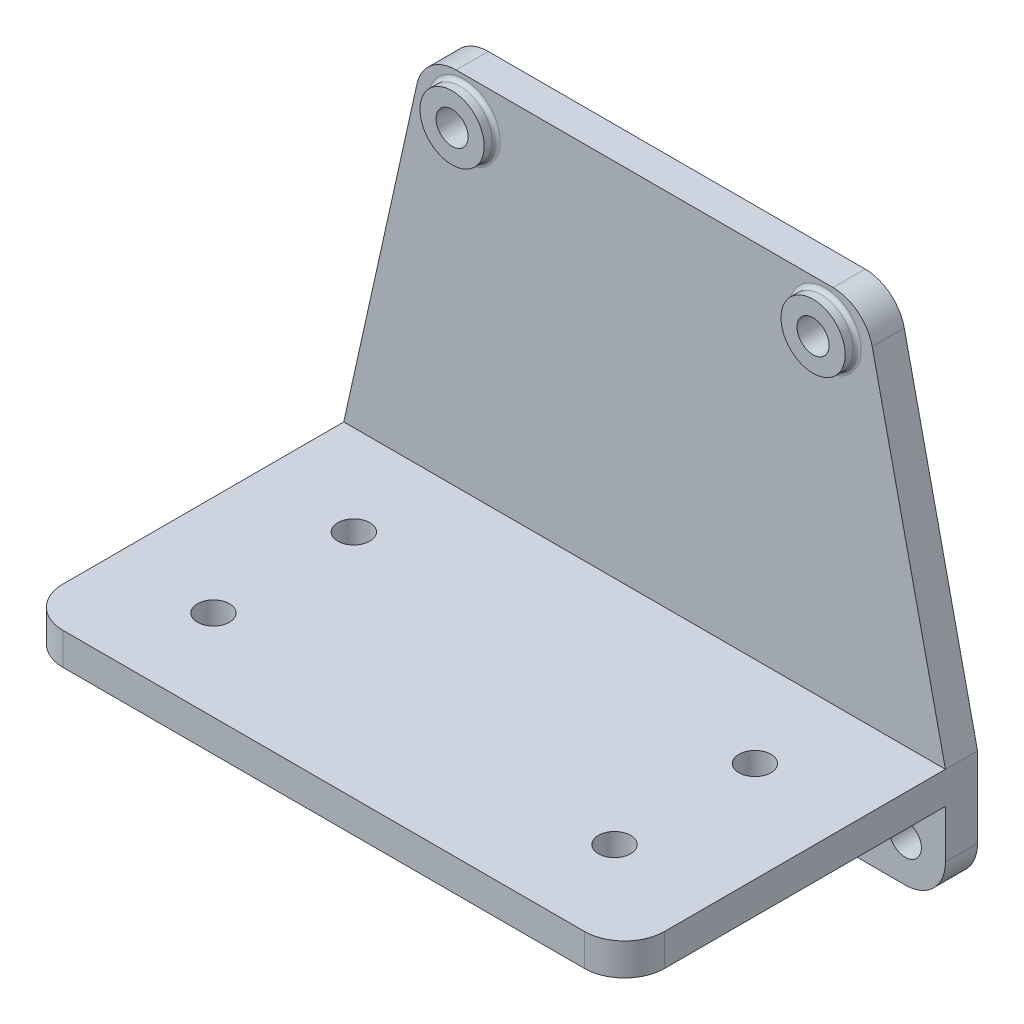
ISO-10303-21;
HEADER;
FILE_DESCRIPTION(('STEP AP214'),'2;1');
FILE_NAME('part.step','',(''),(''),'','','');
FILE_SCHEMA(('AUTOMOTIVE_DESIGN { 1 0 10303 214 1 1 1 1 }'));
ENDSEC;
DATA;
#1=APPLICATION_CONTEXT('core data for automotive mechanical design processes');
#2=APPLICATION_PROTOCOL_DEFINITION('international standard','automotive_design',2000,#1);
#3=PRODUCT_CONTEXT('',#1,'mechanical');
#4=PRODUCT('Part','Part','',(#3));
#5=PRODUCT_RELATED_PRODUCT_CATEGORY('part','',(#4));
#6=PRODUCT_DEFINITION_FORMATION('','',#4);
#7=PRODUCT_DEFINITION_CONTEXT('part definition',#1,'design');
#8=PRODUCT_DEFINITION('design','',#6,#7);
#9=PRODUCT_DEFINITION_SHAPE('','',#8);
#10=(LENGTH_UNIT() NAMED_UNIT(*) SI_UNIT(.MILLI.,.METRE.));
#11=(NAMED_UNIT(*) PLANE_ANGLE_UNIT() SI_UNIT($,.RADIAN.));
#12=(NAMED_UNIT(*) SI_UNIT($,.STERADIAN.) SOLID_ANGLE_UNIT());
#13=UNCERTAINTY_MEASURE_WITH_UNIT(LENGTH_MEASURE(1.E-05),#10,'distance_accuracy_value','');
#14=(GEOMETRIC_REPRESENTATION_CONTEXT(3) GLOBAL_UNCERTAINTY_ASSIGNED_CONTEXT((#13)) GLOBAL_UNIT_ASSIGNED_CONTEXT((#10,
#11,#12)) REPRESENTATION_CONTEXT('',''));
#15=CARTESIAN_POINT('',(0.,0.,0.));
#16=DIRECTION('',(0.,0.,1.));
#17=DIRECTION('',(1.,0.,0.));
#18=AXIS2_PLACEMENT_3D('',#15,#16,#17);
#19=CARTESIAN_POINT('',(0.,0.,8.));
#20=DIRECTION('',(0.,0.,1.));
#21=DIRECTION('',(1.,0.,0.));
#22=AXIS2_PLACEMENT_3D('',#19,#20,#21);
#23=PLANE('',#22);
#24=CARTESIAN_POINT('',(45.,110.,8.));
#25=DIRECTION('',(0.,0.,1.));
#26=DIRECTION('',(1.,0.,0.));
#27=AXIS2_PLACEMENT_3D('',#24,#25,#26);
#28=CIRCLE('',#27,9.);
#29=CARTESIAN_POINT('',(54.,110.,8.));
#30=VERTEX_POINT('',#29);
#31=EDGE_CURVE('E43',#30,#30,#28,.F.);
#32=ORIENTED_EDGE('',*,*,#31,.T.);
#33=EDGE_LOOP('',(#32));
#34=FACE_BOUND('',#33,.T.);
#35=CARTESIAN_POINT('',(-45.,110.,8.));
#36=DIRECTION('',(0.,0.,1.));
#37=DIRECTION('',(1.,0.,0.));
#38=AXIS2_PLACEMENT_3D('',#35,#36,#37);
#39=CIRCLE('',#38,9.);
#40=CARTESIAN_POINT('',(-36.,110.,8.));
#41=VERTEX_POINT('',#40);
#42=EDGE_CURVE('E350',#41,#41,#39,.F.);
#43=ORIENTED_EDGE('',*,*,#42,.T.);
#44=EDGE_LOOP('',(#43));
#45=FACE_BOUND('',#44,.T.);
#46=DIRECTION('',(-0.216930457818656,0.976187060183953,0.));
#47=VECTOR('',#46,1.);
#48=CARTESIAN_POINT('',(75.,30.,8.));
#49=LINE('',#48,#47);
#50=CARTESIAN_POINT('',(75.,30.,8.));
#51=VERTEX_POINT('',#50);
#52=CARTESIAN_POINT('',(56.7401545381808,112.169304578187,8.));
#53=VERTEX_POINT('',#52);
#54=EDGE_CURVE('E312',#51,#53,#49,.T.);
#55=ORIENTED_EDGE('',*,*,#54,.T.);
#56=CARTESIAN_POINT('',(46.9782839363412,110.,8.));
#57=DIRECTION('',(0.,0.,1.));
#58=DIRECTION('',(1.,0.,0.));
#59=AXIS2_PLACEMENT_3D('',#56,#57,#58);
#60=CIRCLE('',#59,10.);
#61=CARTESIAN_POINT('',(46.9782839363412,120.,8.));
#62=VERTEX_POINT('',#61);
#63=EDGE_CURVE('E342',#53,#62,#60,.T.);
#64=ORIENTED_EDGE('',*,*,#63,.T.);
#65=DIRECTION('',(-1.,0.,0.));
#66=VECTOR('',#65,1.);
#67=CARTESIAN_POINT('',(55.,120.,8.));
#68=LINE('',#67,#66);
#69=CARTESIAN_POINT('',(-46.9782839363412,120.,8.));
#70=VERTEX_POINT('',#69);
#71=EDGE_CURVE('E442',#62,#70,#68,.T.);
#72=ORIENTED_EDGE('',*,*,#71,.T.);
#73=CARTESIAN_POINT('',(-46.9782839363412,110.,8.));
#74=DIRECTION('',(0.,0.,-1.));
#75=DIRECTION('',(-1.,0.,0.));
#76=AXIS2_PLACEMENT_3D('',#73,#74,#75);
#77=CIRCLE('',#76,10.);
#78=CARTESIAN_POINT('',(-56.7401545381808,112.169304578187,8.));
#79=VERTEX_POINT('',#78);
#80=EDGE_CURVE('E516',#79,#70,#77,.T.);
#81=ORIENTED_EDGE('',*,*,#80,.F.);
#82=DIRECTION('',(0.216930457818656,0.976187060183953,0.));
#83=VECTOR('',#82,1.);
#84=CARTESIAN_POINT('',(-75.,30.,8.));
#85=LINE('',#84,#83);
#86=CARTESIAN_POINT('',(-75.,30.,8.));
#87=VERTEX_POINT('',#86);
#88=EDGE_CURVE('E292',#87,#79,#85,.T.);
#89=ORIENTED_EDGE('',*,*,#88,.F.);
#90=DIRECTION('',(-1.,0.,0.));
#91=VECTOR('',#90,1.);
#92=CARTESIAN_POINT('',(75.,30.,8.));
#93=LINE('',#92,#91);
#94=EDGE_CURVE('E453',#51,#87,#93,.T.);
#95=ORIENTED_EDGE('',*,*,#94,.F.);
#96=EDGE_LOOP('',(#55,#64,#72,#81,#89,#95));
#97=FACE_BOUND('',#96,.T.);
#98=ADVANCED_FACE('F35',(#34,#45,#97),#23,.T.);
#99=CARTESIAN_POINT('',(0.,10.,8.));
#100=DIRECTION('',(0.,0.,1.));
#101=DIRECTION('',(1.,0.,0.));
#102=AXIS2_PLACEMENT_3D('',#99,#100,#101);
#103=CIRCLE('',#102,4.);
#104=CARTESIAN_POINT('',(4.,10.,8.));
#105=VERTEX_POINT('',#104);
#106=EDGE_CURVE('E428',#105,#105,#103,.T.);
#107=ORIENTED_EDGE('',*,*,#106,.F.);
#108=EDGE_LOOP('',(#107));
#109=FACE_BOUND('',#108,.T.);
#110=DIRECTION('',(1.,0.,0.));
#111=VECTOR('',#110,1.);
#112=CARTESIAN_POINT('',(0.,0.,8.));
#113=LINE('',#112,#111);
#114=CARTESIAN_POINT('',(-31.,0.,8.00000000000002));
#115=VERTEX_POINT('',#114);
#116=CARTESIAN_POINT('',(31.,0.,8.00000000000002));
#117=VERTEX_POINT('',#116);
#118=EDGE_CURVE('E305',#115,#117,#113,.T.);
#119=ORIENTED_EDGE('',*,*,#118,.T.);
#120=DIRECTION('',(0.,1.,0.));
#121=VECTOR('',#120,1.);
#122=CARTESIAN_POINT('',(31.,0.,8.));
#123=LINE('',#122,#121);
#124=CARTESIAN_POINT('',(31.,22.,8.));
#125=VERTEX_POINT('',#124);
#126=EDGE_CURVE('E503',#117,#125,#123,.T.);
#127=ORIENTED_EDGE('',*,*,#126,.T.);
#128=DIRECTION('',(1.,0.,0.));
#129=VECTOR('',#128,1.);
#130=CARTESIAN_POINT('',(75.,22.,8.));
#131=LINE('',#130,#129);
#132=CARTESIAN_POINT('',(-31.,22.,8.));
#133=VERTEX_POINT('',#132);
#134=EDGE_CURVE('E458',#133,#125,#131,.T.);
#135=ORIENTED_EDGE('',*,*,#134,.F.);
#136=DIRECTION('',(0.,1.,0.));
#137=VECTOR('',#136,1.);
#138=CARTESIAN_POINT('',(-31.,0.,8.));
#139=LINE('',#138,#137);
#140=EDGE_CURVE('E221',#115,#133,#139,.T.);
#141=ORIENTED_EDGE('',*,*,#140,.F.);
#142=EDGE_LOOP('',(#119,#127,#135,#141));
#143=FACE_BOUND('',#142,.T.);
#144=ADVANCED_FACE('F398',(#109,#143),#23,.T.);
#145=CARTESIAN_POINT('',(75.,22.,88.));
#146=DIRECTION('',(0.,1.,0.));
#147=DIRECTION('',(-1.,0.,0.));
#148=AXIS2_PLACEMENT_3D('',#145,#146,#147);
#149=PLANE('',#148);
#150=DIRECTION('',(0.,0.,-1.));
#151=VECTOR('',#150,1.);
#152=CARTESIAN_POINT('',(31.,22.,88.));
#153=LINE('',#152,#151);
#154=CARTESIAN_POINT('',(31.,22.,88.));
#155=VERTEX_POINT('',#154);
#156=EDGE_CURVE('E190',#155,#125,#153,.T.);
#157=ORIENTED_EDGE('',*,*,#156,.F.);
#158=DIRECTION('',(1.,0.,0.));
#159=VECTOR('',#158,1.);
#160=CARTESIAN_POINT('',(75.,22.,88.));
#161=LINE('',#160,#159);
#162=CARTESIAN_POINT('',(-31.,22.,88.));
#163=VERTEX_POINT('',#162);
#164=EDGE_CURVE('E183',#163,#155,#161,.T.);
#165=ORIENTED_EDGE('',*,*,#164,.F.);
#166=DIRECTION('',(0.,0.,-1.));
#167=VECTOR('',#166,1.);
#168=CARTESIAN_POINT('',(-31.,22.,88.));
#169=LINE('',#168,#167);
#170=EDGE_CURVE('E188',#163,#133,#169,.T.);
#171=ORIENTED_EDGE('',*,*,#170,.T.);
#172=ORIENTED_EDGE('',*,*,#134,.T.);
#173=EDGE_LOOP('',(#157,#165,#171,#172));
#174=FACE_BOUND('',#173,.T.);
#175=ADVANCED_FACE('F185',(#174),#149,.F.);
#176=CARTESIAN_POINT('',(39.,0.,8.00000000000002));
#177=VERTEX_POINT('',#176);
#178=CARTESIAN_POINT('',(65.,0.,8.));
#179=VERTEX_POINT('',#178);
#180=EDGE_CURVE('E310',#177,#179,#113,.T.);
#181=ORIENTED_EDGE('',*,*,#180,.T.);
#182=CARTESIAN_POINT('',(65.,10.,8.));
#183=DIRECTION('',(0.,0.,1.));
#184=DIRECTION('',(1.,0.,0.));
#185=AXIS2_PLACEMENT_3D('',#182,#183,#184);
#186=CIRCLE('',#185,10.);
#187=CARTESIAN_POINT('',(75.,10.,8.));
#188=VERTEX_POINT('',#187);
#189=EDGE_CURVE('E345',#179,#188,#186,.T.);
#190=ORIENTED_EDGE('',*,*,#189,.T.);
#191=DIRECTION('',(0.,1.,0.));
#192=VECTOR('',#191,1.);
#193=CARTESIAN_POINT('',(75.,0.,8.));
#194=LINE('',#193,#192);
#195=CARTESIAN_POINT('',(75.,22.,8.));
#196=VERTEX_POINT('',#195);
#197=EDGE_CURVE('E309',#188,#196,#194,.T.);
#198=ORIENTED_EDGE('',*,*,#197,.T.);
#199=CARTESIAN_POINT('',(39.,22.,8.));
#200=VERTEX_POINT('',#199);
#201=EDGE_CURVE('E456',#200,#196,#131,.T.);
#202=ORIENTED_EDGE('',*,*,#201,.F.);
#203=DIRECTION('',(0.,1.,0.));
#204=VECTOR('',#203,1.);
#205=CARTESIAN_POINT('',(39.,0.,8.));
#206=LINE('',#205,#204);
#207=EDGE_CURVE('E499',#177,#200,#206,.T.);
#208=ORIENTED_EDGE('',*,*,#207,.F.);
#209=EDGE_LOOP('',(#181,#190,#198,#202,#208));
#210=FACE_BOUND('',#209,.T.);
#211=CARTESIAN_POINT('',(65.,9.99999999999999,8.));
#212=DIRECTION('',(0.,0.,1.));
#213=DIRECTION('',(1.,0.,0.));
#214=AXIS2_PLACEMENT_3D('',#211,#212,#213);
#215=CIRCLE('',#214,4.00000000000001);
#216=CARTESIAN_POINT('',(69.,9.99999999999999,8.));
#217=VERTEX_POINT('',#216);
#218=EDGE_CURVE('E422',#217,#217,#215,.T.);
#219=ORIENTED_EDGE('',*,*,#218,.F.);
#220=EDGE_LOOP('',(#219));
#221=FACE_BOUND('',#220,.T.);
#222=ADVANCED_FACE('F400',(#210,#221),#23,.T.);
#223=CARTESIAN_POINT('',(0.,0.,8.));
#224=DIRECTION('',(0.,1.,0.));
#225=DIRECTION('',(0.,0.,1.));
#226=AXIS2_PLACEMENT_3D('',#223,#224,#225);
#227=PLANE('',#226);
#228=DIRECTION('',(1.,0.,0.));
#229=VECTOR('',#228,1.);
#230=CARTESIAN_POINT('',(0.,0.,0.));
#231=LINE('',#230,#229);
#232=CARTESIAN_POINT('',(-65.,0.,0.));
#233=VERTEX_POINT('',#232);
#234=CARTESIAN_POINT('',(65.,0.,0.));
#235=VERTEX_POINT('',#234);
#236=EDGE_CURVE('E435',#233,#235,#231,.T.);
#237=ORIENTED_EDGE('',*,*,#236,.T.);
#238=DIRECTION('',(0.,0.,-1.));
#239=VECTOR('',#238,1.);
#240=CARTESIAN_POINT('',(65.,0.,8.));
#241=LINE('',#240,#239);
#242=EDGE_CURVE('E50',#235,#179,#241,.F.);
#243=ORIENTED_EDGE('',*,*,#242,.T.);
#244=ORIENTED_EDGE('',*,*,#180,.F.);
#245=DIRECTION('',(1.,0.,0.));
#246=VECTOR('',#245,1.);
#247=CARTESIAN_POINT('',(0.,0.,8.));
#248=LINE('',#247,#246);
#249=EDGE_CURVE('E306',#117,#177,#248,.T.);
#250=ORIENTED_EDGE('',*,*,#249,.F.);
#251=ORIENTED_EDGE('',*,*,#118,.F.);
#252=DIRECTION('',(-1.,0.,0.));
#253=VECTOR('',#252,1.);
#254=CARTESIAN_POINT('',(0.,0.,8.));
#255=LINE('',#254,#253);
#256=CARTESIAN_POINT('',(-39.,0.,8.00000000000002));
#257=VERTEX_POINT('',#256);
#258=EDGE_CURVE('E207',#115,#257,#255,.T.);
#259=ORIENTED_EDGE('',*,*,#258,.T.);
#260=DIRECTION('',(-1.,0.,0.));
#261=VECTOR('',#260,1.);
#262=CARTESIAN_POINT('',(0.,0.,8.));
#263=LINE('',#262,#261);
#264=CARTESIAN_POINT('',(-65.,0.,8.));
#265=VERTEX_POINT('',#264);
#266=EDGE_CURVE('E293',#257,#265,#263,.T.);
#267=ORIENTED_EDGE('',*,*,#266,.T.);
#268=DIRECTION('',(0.,0.,-1.));
#269=VECTOR('',#268,1.);
#270=CARTESIAN_POINT('',(-65.,0.,8.));
#271=LINE('',#270,#269);
#272=EDGE_CURVE('E514',#233,#265,#271,.F.);
#273=ORIENTED_EDGE('',*,*,#272,.F.);
#274=EDGE_LOOP('',(#237,#243,#244,#250,#251,#259,#267,#273));
#275=FACE_BOUND('',#274,.T.);
#276=ADVANCED_FACE('F301',(#275),#227,.F.);
#277=CARTESIAN_POINT('',(75.,0.,8.));
#278=DIRECTION('',(-1.,0.,0.));
#279=DIRECTION('',(0.,0.,1.));
#280=AXIS2_PLACEMENT_3D('',#277,#278,#279);
#281=PLANE('',#280);
#282=DIRECTION('',(0.,0.,-1.));
#283=VECTOR('',#282,1.);
#284=CARTESIAN_POINT('',(75.,30.,88.));
#285=LINE('',#284,#283);
#286=CARTESIAN_POINT('',(75.,30.,78.));
#287=VERTEX_POINT('',#286);
#288=EDGE_CURVE('E425',#287,#51,#285,.T.);
#289=ORIENTED_EDGE('',*,*,#288,.F.);
#290=DIRECTION('',(0.,1.,0.));
#291=VECTOR('',#290,1.);
#292=CARTESIAN_POINT('',(75.,0.,78.));
#293=LINE('',#292,#291);
#294=CARTESIAN_POINT('',(75.,22.,78.));
#295=VERTEX_POINT('',#294);
#296=EDGE_CURVE('E329',#287,#295,#293,.F.);
#297=ORIENTED_EDGE('',*,*,#296,.T.);
#298=DIRECTION('',(0.,0.,-1.));
#299=VECTOR('',#298,1.);
#300=CARTESIAN_POINT('',(75.,22.,88.));
#301=LINE('',#300,#299);
#302=EDGE_CURVE('E194',#295,#196,#301,.T.);
#303=ORIENTED_EDGE('',*,*,#302,.T.);
#304=ORIENTED_EDGE('',*,*,#197,.F.);
#305=DIRECTION('',(0.,0.,-1.));
#306=VECTOR('',#305,1.);
#307=CARTESIAN_POINT('',(75.,10.,8.));
#308=LINE('',#307,#306);
#309=CARTESIAN_POINT('',(75.,10.,0.));
#310=VERTEX_POINT('',#309);
#311=EDGE_CURVE('E326',#188,#310,#308,.T.);
#312=ORIENTED_EDGE('',*,*,#311,.T.);
#313=DIRECTION('',(0.,1.,0.));
#314=VECTOR('',#313,1.);
#315=CARTESIAN_POINT('',(75.,0.,0.));
#316=LINE('',#315,#314);
#317=CARTESIAN_POINT('',(75.,30.,0.));
#318=VERTEX_POINT('',#317);
#319=EDGE_CURVE('E438',#310,#318,#316,.T.);
#320=ORIENTED_EDGE('',*,*,#319,.T.);
#321=DIRECTION('',(0.,0.,-1.));
#322=VECTOR('',#321,1.);
#323=CARTESIAN_POINT('',(75.,30.,8.));
#324=LINE('',#323,#322);
#325=EDGE_CURVE('E446',#51,#318,#324,.T.);
#326=ORIENTED_EDGE('',*,*,#325,.F.);
#327=EDGE_LOOP('',(#289,#297,#303,#304,#312,#320,#326));
#328=FACE_BOUND('',#327,.T.);
#329=ADVANCED_FACE('F413',(#328),#281,.F.);
#330=CARTESIAN_POINT('',(75.,30.,8.));
#331=DIRECTION('',(-0.976187060183953,-0.216930457818656,0.));
#332=DIRECTION('',(0.216930457818656,-0.976187060183953,0.));
#333=AXIS2_PLACEMENT_3D('',#330,#331,#332);
#334=PLANE('',#333);
#335=DIRECTION('',(-0.216930457818656,0.976187060183953,0.));
#336=VECTOR('',#335,1.);
#337=CARTESIAN_POINT('',(75.,30.,0.));
#338=LINE('',#337,#336);
#339=CARTESIAN_POINT('',(56.7401545381808,112.169304578187,0.));
#340=VERTEX_POINT('',#339);
#341=EDGE_CURVE('E440',#318,#340,#338,.T.);
#342=ORIENTED_EDGE('',*,*,#341,.T.);
#343=DIRECTION('',(0.,0.,-1.));
#344=VECTOR('',#343,1.);
#345=CARTESIAN_POINT('',(56.7401545381808,112.169304578187,8.));
#346=LINE('',#345,#344);
#347=EDGE_CURVE('E58',#340,#53,#346,.F.);
#348=ORIENTED_EDGE('',*,*,#347,.T.);
#349=ORIENTED_EDGE('',*,*,#54,.F.);
#350=ORIENTED_EDGE('',*,*,#325,.T.);
#351=EDGE_LOOP('',(#342,#348,#349,#350));
#352=FACE_BOUND('',#351,.T.);
#353=ADVANCED_FACE('F861',(#352),#334,.F.);
#354=CARTESIAN_POINT('',(55.,120.,8.));
#355=DIRECTION('',(0.,-1.,0.));
#356=DIRECTION('',(1.,0.,0.));
#357=AXIS2_PLACEMENT_3D('',#354,#355,#356);
#358=PLANE('',#357);
#359=ORIENTED_EDGE('',*,*,#71,.F.);
#360=DIRECTION('',(0.,0.,-1.));
#361=VECTOR('',#360,1.);
#362=CARTESIAN_POINT('',(46.9782839363412,120.,8.));
#363=LINE('',#362,#361);
#364=CARTESIAN_POINT('',(46.9782839363412,120.,0.));
#365=VERTEX_POINT('',#364);
#366=EDGE_CURVE('E334',#62,#365,#363,.T.);
#367=ORIENTED_EDGE('',*,*,#366,.T.);
#368=DIRECTION('',(-1.,0.,0.));
#369=VECTOR('',#368,1.);
#370=CARTESIAN_POINT('',(55.,120.,0.));
#371=LINE('',#370,#369);
#372=CARTESIAN_POINT('',(-46.9782839363412,120.,0.));
#373=VERTEX_POINT('',#372);
#374=EDGE_CURVE('E314',#365,#373,#371,.T.);
#375=ORIENTED_EDGE('',*,*,#374,.T.);
#376=DIRECTION('',(0.,0.,-1.));
#377=VECTOR('',#376,1.);
#378=CARTESIAN_POINT('',(-46.9782839363412,120.,8.));
#379=LINE('',#378,#377);
#380=EDGE_CURVE('E527',#70,#373,#379,.T.);
#381=ORIENTED_EDGE('',*,*,#380,.F.);
#382=EDGE_LOOP('',(#359,#367,#375,#381));
#383=FACE_BOUND('',#382,.T.);
#384=ADVANCED_FACE('F561',(#383),#358,.F.);
#385=CARTESIAN_POINT('',(0.,0.,0.));
#386=DIRECTION('',(0.,0.,1.));
#387=DIRECTION('',(1.,0.,0.));
#388=AXIS2_PLACEMENT_3D('',#385,#386,#387);
#389=PLANE('',#388);
#390=CARTESIAN_POINT('',(0.,10.,0.));
#391=DIRECTION('',(0.,0.,1.));
#392=DIRECTION('',(1.,0.,0.));
#393=AXIS2_PLACEMENT_3D('',#390,#391,#392);
#394=CIRCLE('',#393,4.);
#395=CARTESIAN_POINT('',(4.,10.,0.));
#396=VERTEX_POINT('',#395);
#397=EDGE_CURVE('E449',#396,#396,#394,.T.);
#398=ORIENTED_EDGE('',*,*,#397,.T.);
#399=EDGE_LOOP('',(#398));
#400=FACE_BOUND('',#399,.T.);
#401=CARTESIAN_POINT('',(65.,9.99999999999999,0.));
#402=DIRECTION('',(0.,0.,1.));
#403=DIRECTION('',(1.,0.,0.));
#404=AXIS2_PLACEMENT_3D('',#401,#402,#403);
#405=CIRCLE('',#404,4.00000000000001);
#406=CARTESIAN_POINT('',(69.,9.99999999999999,0.));
#407=VERTEX_POINT('',#406);
#408=EDGE_CURVE('E424',#407,#407,#405,.T.);
#409=ORIENTED_EDGE('',*,*,#408,.T.);
#410=EDGE_LOOP('',(#409));
#411=FACE_BOUND('',#410,.T.);
#412=CARTESIAN_POINT('',(45.,110.,0.));
#413=DIRECTION('',(0.,0.,1.));
#414=DIRECTION('',(1.,0.,0.));
#415=AXIS2_PLACEMENT_3D('',#412,#413,#414);
#416=CIRCLE('',#415,4.00000000000001);
#417=CARTESIAN_POINT('',(49.,110.,0.));
#418=VERTEX_POINT('',#417);
#419=EDGE_CURVE('E317',#418,#418,#416,.T.);
#420=ORIENTED_EDGE('',*,*,#419,.T.);
#421=EDGE_LOOP('',(#420));
#422=FACE_BOUND('',#421,.T.);
#423=ORIENTED_EDGE('',*,*,#374,.F.);
#424=CARTESIAN_POINT('',(46.9782839363412,110.,0.));
#425=DIRECTION('',(0.,0.,1.));
#426=DIRECTION('',(1.,0.,0.));
#427=AXIS2_PLACEMENT_3D('',#424,#425,#426);
#428=CIRCLE('',#427,10.);
#429=EDGE_CURVE('E339',#365,#340,#428,.F.);
#430=ORIENTED_EDGE('',*,*,#429,.T.);
#431=ORIENTED_EDGE('',*,*,#341,.F.);
#432=ORIENTED_EDGE('',*,*,#319,.F.);
#433=CARTESIAN_POINT('',(65.,10.,0.));
#434=DIRECTION('',(0.,0.,1.));
#435=DIRECTION('',(1.,0.,0.));
#436=AXIS2_PLACEMENT_3D('',#433,#434,#435);
#437=CIRCLE('',#436,10.);
#438=EDGE_CURVE('E337',#310,#235,#437,.F.);
#439=ORIENTED_EDGE('',*,*,#438,.T.);
#440=ORIENTED_EDGE('',*,*,#236,.F.);
#441=CARTESIAN_POINT('',(-65.,10.,0.));
#442=DIRECTION('',(0.,0.,-1.));
#443=DIRECTION('',(-1.,0.,0.));
#444=AXIS2_PLACEMENT_3D('',#441,#442,#443);
#445=CIRCLE('',#444,10.);
#446=CARTESIAN_POINT('',(-75.,10.,0.));
#447=VERTEX_POINT('',#446);
#448=EDGE_CURVE('E524',#447,#233,#445,.F.);
#449=ORIENTED_EDGE('',*,*,#448,.F.);
#450=DIRECTION('',(0.,1.,0.));
#451=VECTOR('',#450,1.);
#452=CARTESIAN_POINT('',(-75.,0.,0.));
#453=LINE('',#452,#451);
#454=CARTESIAN_POINT('',(-75.,30.,0.));
#455=VERTEX_POINT('',#454);
#456=EDGE_CURVE('E535',#447,#455,#453,.T.);
#457=ORIENTED_EDGE('',*,*,#456,.T.);
#458=DIRECTION('',(0.216930457818656,0.976187060183953,0.));
#459=VECTOR('',#458,1.);
#460=CARTESIAN_POINT('',(-75.,30.,0.));
#461=LINE('',#460,#459);
#462=CARTESIAN_POINT('',(-56.7401545381808,112.169304578187,0.));
#463=VERTEX_POINT('',#462);
#464=EDGE_CURVE('E539',#455,#463,#461,.T.);
#465=ORIENTED_EDGE('',*,*,#464,.T.);
#466=CARTESIAN_POINT('',(-46.9782839363412,110.,0.));
#467=DIRECTION('',(0.,0.,-1.));
#468=DIRECTION('',(-1.,0.,0.));
#469=AXIS2_PLACEMENT_3D('',#466,#467,#468);
#470=CIRCLE('',#469,10.);
#471=EDGE_CURVE('E522',#373,#463,#470,.F.);
#472=ORIENTED_EDGE('',*,*,#471,.F.);
#473=EDGE_LOOP('',(#423,#430,#431,#432,#439,#440,#449,#457,#465,#472));
#474=FACE_BOUND('',#473,.T.);
#475=CARTESIAN_POINT('',(-65.,9.99999999999999,0.));
#476=DIRECTION('',(0.,0.,-1.));
#477=DIRECTION('',(-1.,0.,0.));
#478=AXIS2_PLACEMENT_3D('',#475,#476,#477);
#479=CIRCLE('',#478,4.00000000000001);
#480=CARTESIAN_POINT('',(-69.,9.99999999999999,0.));
#481=VERTEX_POINT('',#480);
#482=EDGE_CURVE('E543',#481,#481,#479,.T.);
#483=ORIENTED_EDGE('',*,*,#482,.F.);
#484=EDGE_LOOP('',(#483));
#485=FACE_BOUND('',#484,.T.);
#486=CARTESIAN_POINT('',(-45.,110.,0.));
#487=DIRECTION('',(0.,0.,-1.));
#488=DIRECTION('',(-1.,0.,0.));
#489=AXIS2_PLACEMENT_3D('',#486,#487,#488);
#490=CIRCLE('',#489,4.00000000000001);
#491=CARTESIAN_POINT('',(-49.,110.,0.));
#492=VERTEX_POINT('',#491);
#493=EDGE_CURVE('E540',#492,#492,#490,.T.);
#494=ORIENTED_EDGE('',*,*,#493,.F.);
#495=EDGE_LOOP('',(#494));
#496=FACE_BOUND('',#495,.T.);
#497=ADVANCED_FACE('F557',(#400,#411,#422,#474,#485,#496),#389,.F.);
#498=CARTESIAN_POINT('',(45.,110.,0.));
#499=DIRECTION('',(0.,0.,1.));
#500=DIRECTION('',(1.,0.,0.));
#501=AXIS2_PLACEMENT_3D('',#498,#499,#500);
#502=CYLINDRICAL_SURFACE('',#501,4.00000000000001);
#503=ORIENTED_EDGE('',*,*,#419,.F.);
#504=EDGE_LOOP('',(#503));
#505=FACE_BOUND('',#504,.T.);
#506=CARTESIAN_POINT('',(45.,110.,11.));
#507=DIRECTION('',(0.,0.,1.));
#508=DIRECTION('',(1.,0.,0.));
#509=AXIS2_PLACEMENT_3D('',#506,#507,#508);
#510=CIRCLE('',#509,4.00000000000001);
#511=CARTESIAN_POINT('',(49.,110.,11.));
#512=VERTEX_POINT('',#511);
#513=EDGE_CURVE('E372',#512,#512,#510,.T.);
#514=ORIENTED_EDGE('',*,*,#513,.T.);
#515=EDGE_LOOP('',(#514));
#516=FACE_BOUND('',#515,.T.);
#517=ADVANCED_FACE('F560',(#505,#516),#502,.F.);
#518=CARTESIAN_POINT('',(0.,10.,0.));
#519=DIRECTION('',(0.,0.,1.));
#520=DIRECTION('',(1.,0.,0.));
#521=AXIS2_PLACEMENT_3D('',#518,#519,#520);
#522=CYLINDRICAL_SURFACE('',#521,4.);
#523=ORIENTED_EDGE('',*,*,#106,.T.);
#524=EDGE_LOOP('',(#523));
#525=FACE_BOUND('',#524,.T.);
#526=ORIENTED_EDGE('',*,*,#397,.F.);
#527=EDGE_LOOP('',(#526));
#528=FACE_BOUND('',#527,.T.);
#529=ADVANCED_FACE('F624',(#525,#528),#522,.F.);
#530=CARTESIAN_POINT('',(65.,9.99999999999999,0.));
#531=DIRECTION('',(0.,0.,1.));
#532=DIRECTION('',(1.,0.,0.));
#533=AXIS2_PLACEMENT_3D('',#530,#531,#532);
#534=CYLINDRICAL_SURFACE('',#533,4.00000000000001);
#535=ORIENTED_EDGE('',*,*,#408,.F.);
#536=EDGE_LOOP('',(#535));
#537=FACE_BOUND('',#536,.T.);
#538=ORIENTED_EDGE('',*,*,#218,.T.);
#539=EDGE_LOOP('',(#538));
#540=FACE_BOUND('',#539,.T.);
#541=ADVANCED_FACE('F620',(#537,#540),#534,.F.);
#542=CARTESIAN_POINT('',(75.,30.,88.));
#543=DIRECTION('',(0.,-1.,0.));
#544=DIRECTION('',(0.,0.,-1.));
#545=AXIS2_PLACEMENT_3D('',#542,#543,#544);
#546=PLANE('',#545);
#547=CARTESIAN_POINT('',(50.,30.,30.5));
#548=DIRECTION('',(0.,1.,0.));
#549=DIRECTION('',(0.,0.,1.));
#550=AXIS2_PLACEMENT_3D('',#547,#548,#549);
#551=CIRCLE('',#550,4.00000000000001);
#552=CARTESIAN_POINT('',(50.,30.,34.5));
#553=VERTEX_POINT('',#552);
#554=EDGE_CURVE('E495',#553,#553,#551,.T.);
#555=ORIENTED_EDGE('',*,*,#554,.F.);
#556=EDGE_LOOP('',(#555));
#557=FACE_BOUND('',#556,.T.);
#558=CARTESIAN_POINT('',(50.,30.,65.5));
#559=DIRECTION('',(0.,1.,0.));
#560=DIRECTION('',(0.,0.,1.));
#561=AXIS2_PLACEMENT_3D('',#558,#559,#560);
#562=CIRCLE('',#561,4.00000000000001);
#563=CARTESIAN_POINT('',(50.,30.,69.5));
#564=VERTEX_POINT('',#563);
#565=EDGE_CURVE('E492',#564,#564,#562,.T.);
#566=ORIENTED_EDGE('',*,*,#565,.F.);
#567=EDGE_LOOP('',(#566));
#568=FACE_BOUND('',#567,.T.);
#569=DIRECTION('',(-1.,0.,0.));
#570=VECTOR('',#569,1.);
#571=CARTESIAN_POINT('',(75.,30.,88.));
#572=LINE('',#571,#570);
#573=CARTESIAN_POINT('',(65.,30.,88.));
#574=VERTEX_POINT('',#573);
#575=CARTESIAN_POINT('',(-65.,30.,88.));
#576=VERTEX_POINT('',#575);
#577=EDGE_CURVE('E478',#574,#576,#572,.T.);
#578=ORIENTED_EDGE('',*,*,#577,.F.);
#579=CARTESIAN_POINT('',(65.,30.,78.));
#580=DIRECTION('',(0.,-1.,0.));
#581=DIRECTION('',(0.,0.,-1.));
#582=AXIS2_PLACEMENT_3D('',#579,#580,#581);
#583=CIRCLE('',#582,10.);
#584=EDGE_CURVE('E330',#574,#287,#583,.F.);
#585=ORIENTED_EDGE('',*,*,#584,.T.);
#586=ORIENTED_EDGE('',*,*,#288,.T.);
#587=ORIENTED_EDGE('',*,*,#94,.T.);
#588=DIRECTION('',(0.,0.,-1.));
#589=VECTOR('',#588,1.);
#590=CARTESIAN_POINT('',(-75.,30.,88.));
#591=LINE('',#590,#589);
#592=CARTESIAN_POINT('',(-75.,30.,78.));
#593=VERTEX_POINT('',#592);
#594=EDGE_CURVE('E243',#593,#87,#591,.T.);
#595=ORIENTED_EDGE('',*,*,#594,.F.);
#596=CARTESIAN_POINT('',(-65.,30.,78.));
#597=DIRECTION('',(0.,1.,0.));
#598=DIRECTION('',(0.,0.,-1.));
#599=AXIS2_PLACEMENT_3D('',#596,#597,#598);
#600=CIRCLE('',#599,10.);
#601=EDGE_CURVE('E253',#576,#593,#600,.F.);
#602=ORIENTED_EDGE('',*,*,#601,.F.);
#603=EDGE_LOOP('',(#578,#585,#586,#587,#595,#602));
#604=FACE_BOUND('',#603,.T.);
#605=CARTESIAN_POINT('',(-50.,30.,30.5));
#606=DIRECTION('',(0.,-1.,0.));
#607=DIRECTION('',(0.,0.,1.));
#608=AXIS2_PLACEMENT_3D('',#605,#606,#607);
#609=CIRCLE('',#608,4.00000000000001);
#610=CARTESIAN_POINT('',(-50.,30.,34.5));
#611=VERTEX_POINT('',#610);
#612=EDGE_CURVE('E232',#611,#611,#609,.T.);
#613=ORIENTED_EDGE('',*,*,#612,.T.);
#614=EDGE_LOOP('',(#613));
#615=FACE_BOUND('',#614,.T.);
#616=CARTESIAN_POINT('',(-50.,30.,65.5));
#617=DIRECTION('',(0.,-1.,0.));
#618=DIRECTION('',(0.,0.,1.));
#619=AXIS2_PLACEMENT_3D('',#616,#617,#618);
#620=CIRCLE('',#619,4.00000000000001);
#621=CARTESIAN_POINT('',(-50.,30.,69.5));
#622=VERTEX_POINT('',#621);
#623=EDGE_CURVE('E236',#622,#622,#620,.T.);
#624=ORIENTED_EDGE('',*,*,#623,.T.);
#625=EDGE_LOOP('',(#624));
#626=FACE_BOUND('',#625,.T.);
#627=ADVANCED_FACE('F474',(#557,#568,#604,#615,#626),#546,.F.);
#628=CARTESIAN_POINT('',(50.,22.,30.5));
#629=DIRECTION('',(0.,1.,0.));
#630=DIRECTION('',(-1.,0.,0.));
#631=AXIS2_PLACEMENT_3D('',#628,#629,#630);
#632=CIRCLE('',#631,4.00000000000001);
#633=CARTESIAN_POINT('',(46.,22.,30.5));
#634=VERTEX_POINT('',#633);
#635=EDGE_CURVE('E468',#634,#634,#632,.T.);
#636=ORIENTED_EDGE('',*,*,#635,.T.);
#637=EDGE_LOOP('',(#636));
#638=FACE_BOUND('',#637,.T.);
#639=CARTESIAN_POINT('',(50.,22.,65.5));
#640=DIRECTION('',(0.,1.,0.));
#641=DIRECTION('',(-1.,0.,0.));
#642=AXIS2_PLACEMENT_3D('',#639,#640,#641);
#643=CIRCLE('',#642,4.00000000000001);
#644=CARTESIAN_POINT('',(46.,22.,65.5));
#645=VERTEX_POINT('',#644);
#646=EDGE_CURVE('E457',#645,#645,#643,.T.);
#647=ORIENTED_EDGE('',*,*,#646,.T.);
#648=EDGE_LOOP('',(#647));
#649=FACE_BOUND('',#648,.T.);
#650=ORIENTED_EDGE('',*,*,#302,.F.);
#651=CARTESIAN_POINT('',(65.,22.,78.));
#652=DIRECTION('',(0.,1.,0.));
#653=DIRECTION('',(-1.,0.,0.));
#654=AXIS2_PLACEMENT_3D('',#651,#652,#653);
#655=CIRCLE('',#654,10.);
#656=CARTESIAN_POINT('',(65.,22.,88.));
#657=VERTEX_POINT('',#656);
#658=EDGE_CURVE('E332',#295,#657,#655,.F.);
#659=ORIENTED_EDGE('',*,*,#658,.T.);
#660=CARTESIAN_POINT('',(39.,22.,88.));
#661=VERTEX_POINT('',#660);
#662=EDGE_CURVE('E197',#661,#657,#161,.T.);
#663=ORIENTED_EDGE('',*,*,#662,.F.);
#664=DIRECTION('',(0.,0.,-1.));
#665=VECTOR('',#664,1.);
#666=CARTESIAN_POINT('',(39.,22.,88.));
#667=LINE('',#666,#665);
#668=EDGE_CURVE('E501',#661,#200,#667,.T.);
#669=ORIENTED_EDGE('',*,*,#668,.T.);
#670=ORIENTED_EDGE('',*,*,#201,.T.);
#671=EDGE_LOOP('',(#650,#659,#663,#669,#670));
#672=FACE_BOUND('',#671,.T.);
#673=ADVANCED_FACE('F416',(#638,#649,#672),#149,.F.);
#674=CARTESIAN_POINT('',(0.,0.,88.));
#675=DIRECTION('',(0.,0.,-1.));
#676=DIRECTION('',(-1.,0.,0.));
#677=AXIS2_PLACEMENT_3D('',#674,#675,#676);
#678=PLANE('',#677);
#679=ORIENTED_EDGE('',*,*,#662,.T.);
#680=DIRECTION('',(0.,1.,0.));
#681=VECTOR('',#680,1.);
#682=CARTESIAN_POINT('',(65.,0.,88.));
#683=LINE('',#682,#681);
#684=EDGE_CURVE('E452',#657,#574,#683,.T.);
#685=ORIENTED_EDGE('',*,*,#684,.T.);
#686=ORIENTED_EDGE('',*,*,#577,.T.);
#687=DIRECTION('',(0.,1.,0.));
#688=VECTOR('',#687,1.);
#689=CARTESIAN_POINT('',(-65.,0.,88.));
#690=LINE('',#689,#688);
#691=CARTESIAN_POINT('',(-65.,22.,88.));
#692=VERTEX_POINT('',#691);
#693=EDGE_CURVE('E250',#692,#576,#690,.T.);
#694=ORIENTED_EDGE('',*,*,#693,.F.);
#695=DIRECTION('',(-1.,0.,0.));
#696=VECTOR('',#695,1.);
#697=CARTESIAN_POINT('',(-75.,22.,88.));
#698=LINE('',#697,#696);
#699=CARTESIAN_POINT('',(-39.,22.,88.));
#700=VERTEX_POINT('',#699);
#701=EDGE_CURVE('E216',#700,#692,#698,.T.);
#702=ORIENTED_EDGE('',*,*,#701,.F.);
#703=EDGE_CURVE('E204',#163,#700,#698,.T.);
#704=ORIENTED_EDGE('',*,*,#703,.F.);
#705=ORIENTED_EDGE('',*,*,#164,.T.);
#706=EDGE_CURVE('E195',#155,#661,#161,.T.);
#707=ORIENTED_EDGE('',*,*,#706,.T.);
#708=EDGE_LOOP('',(#679,#685,#686,#694,#702,#704,#705,#707));
#709=FACE_BOUND('',#708,.T.);
#710=ADVANCED_FACE('F214',(#709),#678,.F.);
#711=CARTESIAN_POINT('',(50.,-2.50000000007189E-05,65.5));
#712=DIRECTION('',(0.,1.,0.));
#713=DIRECTION('',(0.,0.,1.));
#714=AXIS2_PLACEMENT_3D('',#711,#712,#713);
#715=CYLINDRICAL_SURFACE('',#714,4.00000000000001);
#716=ORIENTED_EDGE('',*,*,#565,.T.);
#717=EDGE_LOOP('',(#716));
#718=FACE_BOUND('',#717,.T.);
#719=ORIENTED_EDGE('',*,*,#646,.F.);
#720=EDGE_LOOP('',(#719));
#721=FACE_BOUND('',#720,.T.);
#722=ADVANCED_FACE('F609',(#718,#721),#715,.F.);
#723=CARTESIAN_POINT('',(50.,-2.50000000007189E-05,30.5));
#724=DIRECTION('',(0.,1.,0.));
#725=DIRECTION('',(0.,0.,1.));
#726=AXIS2_PLACEMENT_3D('',#723,#724,#725);
#727=CYLINDRICAL_SURFACE('',#726,4.00000000000001);
#728=ORIENTED_EDGE('',*,*,#554,.T.);
#729=EDGE_LOOP('',(#728));
#730=FACE_BOUND('',#729,.T.);
#731=ORIENTED_EDGE('',*,*,#635,.F.);
#732=EDGE_LOOP('',(#731));
#733=FACE_BOUND('',#732,.T.);
#734=ADVANCED_FACE('F605',(#730,#733),#727,.F.);
#735=CARTESIAN_POINT('',(35.,22.,88.));
#736=DIRECTION('',(0.,-0.96420539280379,0.265156483021042));
#737=DIRECTION('',(0.,-0.265156483021042,-0.96420539280379));
#738=AXIS2_PLACEMENT_3D('',#735,#736,#737);
#739=PLANE('',#738);
#740=DIRECTION('',(0.,-0.265156483021042,-0.96420539280379));
#741=VECTOR('',#740,1.);
#742=CARTESIAN_POINT('',(31.,22.,88.));
#743=LINE('',#742,#741);
#744=EDGE_CURVE('E507',#155,#117,#743,.T.);
#745=ORIENTED_EDGE('',*,*,#744,.T.);
#746=ORIENTED_EDGE('',*,*,#249,.T.);
#747=DIRECTION('',(0.,-0.265156483021042,-0.96420539280379));
#748=VECTOR('',#747,1.);
#749=CARTESIAN_POINT('',(39.,22.,88.));
#750=LINE('',#749,#748);
#751=EDGE_CURVE('E506',#661,#177,#750,.T.);
#752=ORIENTED_EDGE('',*,*,#751,.F.);
#753=ORIENTED_EDGE('',*,*,#706,.F.);
#754=EDGE_LOOP('',(#745,#746,#752,#753));
#755=FACE_BOUND('',#754,.T.);
#756=ADVANCED_FACE('F598',(#755),#739,.T.);
#757=CARTESIAN_POINT('',(39.,60.,44.0000125));
#758=DIRECTION('',(1.,0.,0.));
#759=DIRECTION('',(0.,0.,-1.));
#760=AXIS2_PLACEMENT_3D('',#757,#758,#759);
#761=PLANE('',#760);
#762=ORIENTED_EDGE('',*,*,#751,.T.);
#763=ORIENTED_EDGE('',*,*,#207,.T.);
#764=ORIENTED_EDGE('',*,*,#668,.F.);
#765=EDGE_LOOP('',(#762,#763,#764));
#766=FACE_BOUND('',#765,.T.);
#767=ADVANCED_FACE('F594',(#766),#761,.T.);
#768=CARTESIAN_POINT('',(31.,60.,44.0000125));
#769=DIRECTION('',(1.,0.,0.));
#770=DIRECTION('',(0.,0.,-1.));
#771=AXIS2_PLACEMENT_3D('',#768,#769,#770);
#772=PLANE('',#771);
#773=ORIENTED_EDGE('',*,*,#126,.F.);
#774=ORIENTED_EDGE('',*,*,#744,.F.);
#775=ORIENTED_EDGE('',*,*,#156,.T.);
#776=EDGE_LOOP('',(#773,#774,#775));
#777=FACE_BOUND('',#776,.T.);
#778=ADVANCED_FACE('F597',(#777),#772,.F.);
#779=CARTESIAN_POINT('',(65.,0.,78.));
#780=DIRECTION('',(0.,1.,0.));
#781=DIRECTION('',(0.,0.,1.));
#782=AXIS2_PLACEMENT_3D('',#779,#780,#781);
#783=CYLINDRICAL_SURFACE('',#782,10.);
#784=ORIENTED_EDGE('',*,*,#658,.F.);
#785=ORIENTED_EDGE('',*,*,#296,.F.);
#786=ORIENTED_EDGE('',*,*,#584,.F.);
#787=ORIENTED_EDGE('',*,*,#684,.F.);
#788=EDGE_LOOP('',(#784,#785,#786,#787));
#789=FACE_BOUND('',#788,.T.);
#790=ADVANCED_FACE('F487',(#789),#783,.T.);
#791=CARTESIAN_POINT('',(46.9782839363412,110.,8.));
#792=DIRECTION('',(0.,0.,-1.));
#793=DIRECTION('',(-1.,0.,0.));
#794=AXIS2_PLACEMENT_3D('',#791,#792,#793);
#795=CYLINDRICAL_SURFACE('',#794,10.);
#796=ORIENTED_EDGE('',*,*,#63,.F.);
#797=ORIENTED_EDGE('',*,*,#347,.F.);
#798=ORIENTED_EDGE('',*,*,#429,.F.);
#799=ORIENTED_EDGE('',*,*,#366,.F.);
#800=EDGE_LOOP('',(#796,#797,#798,#799));
#801=FACE_BOUND('',#800,.T.);
#802=ADVANCED_FACE('F697',(#801),#795,.T.);
#803=CARTESIAN_POINT('',(65.,10.,8.));
#804=DIRECTION('',(0.,0.,-1.));
#805=DIRECTION('',(-1.,0.,0.));
#806=AXIS2_PLACEMENT_3D('',#803,#804,#805);
#807=CYLINDRICAL_SURFACE('',#806,10.);
#808=ORIENTED_EDGE('',*,*,#189,.F.);
#809=ORIENTED_EDGE('',*,*,#242,.F.);
#810=ORIENTED_EDGE('',*,*,#438,.F.);
#811=ORIENTED_EDGE('',*,*,#311,.F.);
#812=EDGE_LOOP('',(#808,#809,#810,#811));
#813=FACE_BOUND('',#812,.T.);
#814=ADVANCED_FACE('F580',(#813),#807,.T.);
#815=CARTESIAN_POINT('',(0.,0.,8.));
#816=DIRECTION('',(0.,0.,1.));
#817=DIRECTION('',(-1.,0.,0.));
#818=AXIS2_PLACEMENT_3D('',#815,#816,#817);
#819=PLANE('',#818);
#820=ORIENTED_EDGE('',*,*,#266,.F.);
#821=DIRECTION('',(0.,1.,0.));
#822=VECTOR('',#821,1.);
#823=CARTESIAN_POINT('',(-39.,0.,8.));
#824=LINE('',#823,#822);
#825=CARTESIAN_POINT('',(-39.,22.,8.));
#826=VERTEX_POINT('',#825);
#827=EDGE_CURVE('E228',#257,#826,#824,.T.);
#828=ORIENTED_EDGE('',*,*,#827,.T.);
#829=DIRECTION('',(-1.,0.,0.));
#830=VECTOR('',#829,1.);
#831=CARTESIAN_POINT('',(-75.,22.,8.));
#832=LINE('',#831,#830);
#833=CARTESIAN_POINT('',(-75.,22.,8.));
#834=VERTEX_POINT('',#833);
#835=EDGE_CURVE('E240',#826,#834,#832,.T.);
#836=ORIENTED_EDGE('',*,*,#835,.T.);
#837=DIRECTION('',(0.,1.,0.));
#838=VECTOR('',#837,1.);
#839=CARTESIAN_POINT('',(-75.,0.,8.));
#840=LINE('',#839,#838);
#841=CARTESIAN_POINT('',(-75.,10.,8.));
#842=VERTEX_POINT('',#841);
#843=EDGE_CURVE('E259',#842,#834,#840,.T.);
#844=ORIENTED_EDGE('',*,*,#843,.F.);
#845=CARTESIAN_POINT('',(-65.,10.,8.));
#846=DIRECTION('',(0.,0.,-1.));
#847=DIRECTION('',(-1.,0.,0.));
#848=AXIS2_PLACEMENT_3D('',#845,#846,#847);
#849=CIRCLE('',#848,10.);
#850=EDGE_CURVE('E510',#265,#842,#849,.T.);
#851=ORIENTED_EDGE('',*,*,#850,.F.);
#852=EDGE_LOOP('',(#820,#828,#836,#844,#851));
#853=FACE_BOUND('',#852,.T.);
#854=CARTESIAN_POINT('',(-65.,9.99999999999999,8.));
#855=DIRECTION('',(0.,0.,-1.));
#856=DIRECTION('',(-1.,0.,0.));
#857=AXIS2_PLACEMENT_3D('',#854,#855,#856);
#858=CIRCLE('',#857,4.00000000000001);
#859=CARTESIAN_POINT('',(-69.,9.99999999999999,8.));
#860=VERTEX_POINT('',#859);
#861=EDGE_CURVE('E550',#860,#860,#858,.T.);
#862=ORIENTED_EDGE('',*,*,#861,.T.);
#863=EDGE_LOOP('',(#862));
#864=FACE_BOUND('',#863,.T.);
#865=ADVANCED_FACE('F295',(#853,#864),#819,.T.);
#866=CARTESIAN_POINT('',(-75.,0.,8.));
#867=DIRECTION('',(1.,0.,0.));
#868=DIRECTION('',(0.,0.,1.));
#869=AXIS2_PLACEMENT_3D('',#866,#867,#868);
#870=PLANE('',#869);
#871=ORIENTED_EDGE('',*,*,#594,.T.);
#872=DIRECTION('',(0.,0.,-1.));
#873=VECTOR('',#872,1.);
#874=CARTESIAN_POINT('',(-75.,30.,8.));
#875=LINE('',#874,#873);
#876=EDGE_CURVE('E254',#87,#455,#875,.T.);
#877=ORIENTED_EDGE('',*,*,#876,.T.);
#878=ORIENTED_EDGE('',*,*,#456,.F.);
#879=DIRECTION('',(0.,0.,-1.));
#880=VECTOR('',#879,1.);
#881=CARTESIAN_POINT('',(-75.,10.,8.));
#882=LINE('',#881,#880);
#883=EDGE_CURVE('E256',#842,#447,#882,.T.);
#884=ORIENTED_EDGE('',*,*,#883,.F.);
#885=ORIENTED_EDGE('',*,*,#843,.T.);
#886=DIRECTION('',(0.,0.,-1.));
#887=VECTOR('',#886,1.);
#888=CARTESIAN_POINT('',(-75.,22.,88.));
#889=LINE('',#888,#887);
#890=CARTESIAN_POINT('',(-75.,22.,78.));
#891=VERTEX_POINT('',#890);
#892=EDGE_CURVE('E218',#891,#834,#889,.T.);
#893=ORIENTED_EDGE('',*,*,#892,.F.);
#894=DIRECTION('',(0.,1.,0.));
#895=VECTOR('',#894,1.);
#896=CARTESIAN_POINT('',(-75.,0.,78.));
#897=LINE('',#896,#895);
#898=EDGE_CURVE('E531',#593,#891,#897,.F.);
#899=ORIENTED_EDGE('',*,*,#898,.F.);
#900=EDGE_LOOP('',(#871,#877,#878,#884,#885,#893,#899));
#901=FACE_BOUND('',#900,.T.);
#902=ADVANCED_FACE('F286',(#901),#870,.F.);
#903=CARTESIAN_POINT('',(-75.,30.,8.));
#904=DIRECTION('',(0.976187060183953,-0.216930457818656,0.));
#905=DIRECTION('',(-0.216930457818656,-0.976187060183953,0.));
#906=AXIS2_PLACEMENT_3D('',#903,#904,#905);
#907=PLANE('',#906);
#908=ORIENTED_EDGE('',*,*,#464,.F.);
#909=ORIENTED_EDGE('',*,*,#876,.F.);
#910=ORIENTED_EDGE('',*,*,#88,.T.);
#911=DIRECTION('',(0.,0.,-1.));
#912=VECTOR('',#911,1.);
#913=CARTESIAN_POINT('',(-56.7401545381808,112.169304578187,8.));
#914=LINE('',#913,#912);
#915=EDGE_CURVE('E519',#463,#79,#914,.F.);
#916=ORIENTED_EDGE('',*,*,#915,.F.);
#917=EDGE_LOOP('',(#908,#909,#910,#916));
#918=FACE_BOUND('',#917,.T.);
#919=ADVANCED_FACE('F568',(#918),#907,.F.);
#920=CARTESIAN_POINT('',(-45.,110.,0.));
#921=DIRECTION('',(0.,0.,1.));
#922=DIRECTION('',(-1.,0.,0.));
#923=AXIS2_PLACEMENT_3D('',#920,#921,#922);
#924=CYLINDRICAL_SURFACE('',#923,4.00000000000001);
#925=ORIENTED_EDGE('',*,*,#493,.T.);
#926=EDGE_LOOP('',(#925));
#927=FACE_BOUND('',#926,.T.);
#928=CARTESIAN_POINT('',(-45.,110.,11.));
#929=DIRECTION('',(0.,0.,1.));
#930=DIRECTION('',(1.,0.,0.));
#931=AXIS2_PLACEMENT_3D('',#928,#929,#930);
#932=CIRCLE('',#931,4.00000000000001);
#933=CARTESIAN_POINT('',(-41.,110.,11.));
#934=VERTEX_POINT('',#933);
#935=EDGE_CURVE('E371',#934,#934,#932,.T.);
#936=ORIENTED_EDGE('',*,*,#935,.T.);
#937=EDGE_LOOP('',(#936));
#938=FACE_BOUND('',#937,.T.);
#939=ADVANCED_FACE('F565',(#927,#938),#924,.F.);
#940=CARTESIAN_POINT('',(-65.,9.99999999999999,0.));
#941=DIRECTION('',(0.,0.,1.));
#942=DIRECTION('',(-1.,0.,0.));
#943=AXIS2_PLACEMENT_3D('',#940,#941,#942);
#944=CYLINDRICAL_SURFACE('',#943,4.00000000000001);
#945=ORIENTED_EDGE('',*,*,#482,.T.);
#946=EDGE_LOOP('',(#945));
#947=FACE_BOUND('',#946,.T.);
#948=ORIENTED_EDGE('',*,*,#861,.F.);
#949=EDGE_LOOP('',(#948));
#950=FACE_BOUND('',#949,.T.);
#951=ADVANCED_FACE('F273',(#947,#950),#944,.F.);
#952=CARTESIAN_POINT('',(-75.,22.,88.));
#953=DIRECTION('',(0.,1.,0.));
#954=DIRECTION('',(1.,0.,0.));
#955=AXIS2_PLACEMENT_3D('',#952,#953,#954);
#956=PLANE('',#955);
#957=CARTESIAN_POINT('',(-50.,22.,30.5));
#958=DIRECTION('',(0.,-1.,0.));
#959=DIRECTION('',(1.,0.,0.));
#960=AXIS2_PLACEMENT_3D('',#957,#958,#959);
#961=CIRCLE('',#960,4.00000000000001);
#962=CARTESIAN_POINT('',(-46.,22.,30.5));
#963=VERTEX_POINT('',#962);
#964=EDGE_CURVE('E235',#963,#963,#961,.T.);
#965=ORIENTED_EDGE('',*,*,#964,.F.);
#966=EDGE_LOOP('',(#965));
#967=FACE_BOUND('',#966,.T.);
#968=CARTESIAN_POINT('',(-50.,22.,65.5));
#969=DIRECTION('',(0.,-1.,0.));
#970=DIRECTION('',(1.,0.,0.));
#971=AXIS2_PLACEMENT_3D('',#968,#969,#970);
#972=CIRCLE('',#971,4.00000000000001);
#973=CARTESIAN_POINT('',(-46.,22.,65.5));
#974=VERTEX_POINT('',#973);
#975=EDGE_CURVE('E238',#974,#974,#972,.T.);
#976=ORIENTED_EDGE('',*,*,#975,.F.);
#977=EDGE_LOOP('',(#976));
#978=FACE_BOUND('',#977,.T.);
#979=ORIENTED_EDGE('',*,*,#892,.T.);
#980=ORIENTED_EDGE('',*,*,#835,.F.);
#981=DIRECTION('',(0.,0.,-1.));
#982=VECTOR('',#981,1.);
#983=CARTESIAN_POINT('',(-39.,22.,88.));
#984=LINE('',#983,#982);
#985=EDGE_CURVE('E223',#700,#826,#984,.T.);
#986=ORIENTED_EDGE('',*,*,#985,.F.);
#987=ORIENTED_EDGE('',*,*,#701,.T.);
#988=CARTESIAN_POINT('',(-65.,22.,78.));
#989=DIRECTION('',(0.,-1.,0.));
#990=DIRECTION('',(1.,0.,0.));
#991=AXIS2_PLACEMENT_3D('',#988,#989,#990);
#992=CIRCLE('',#991,10.);
#993=EDGE_CURVE('E280',#891,#692,#992,.F.);
#994=ORIENTED_EDGE('',*,*,#993,.F.);
#995=EDGE_LOOP('',(#979,#980,#986,#987,#994));
#996=FACE_BOUND('',#995,.T.);
#997=ADVANCED_FACE('F270',(#967,#978,#996),#956,.F.);
#998=CARTESIAN_POINT('',(-50.,-2.50000000007189E-05,65.5));
#999=DIRECTION('',(0.,1.,0.));
#1000=DIRECTION('',(0.,0.,1.));
#1001=AXIS2_PLACEMENT_3D('',#998,#999,#1000);
#1002=CYLINDRICAL_SURFACE('',#1001,4.00000000000001);
#1003=ORIENTED_EDGE('',*,*,#623,.F.);
#1004=EDGE_LOOP('',(#1003));
#1005=FACE_BOUND('',#1004,.T.);
#1006=ORIENTED_EDGE('',*,*,#975,.T.);
#1007=EDGE_LOOP('',(#1006));
#1008=FACE_BOUND('',#1007,.T.);
#1009=ADVANCED_FACE('F268',(#1005,#1008),#1002,.F.);
#1010=CARTESIAN_POINT('',(-50.,-2.50000000007189E-05,30.5));
#1011=DIRECTION('',(0.,1.,0.));
#1012=DIRECTION('',(0.,0.,1.));
#1013=AXIS2_PLACEMENT_3D('',#1010,#1011,#1012);
#1014=CYLINDRICAL_SURFACE('',#1013,4.00000000000001);
#1015=ORIENTED_EDGE('',*,*,#612,.F.);
#1016=EDGE_LOOP('',(#1015));
#1017=FACE_BOUND('',#1016,.T.);
#1018=ORIENTED_EDGE('',*,*,#964,.T.);
#1019=EDGE_LOOP('',(#1018));
#1020=FACE_BOUND('',#1019,.T.);
#1021=ADVANCED_FACE('F748',(#1017,#1020),#1014,.F.);
#1022=CARTESIAN_POINT('',(-35.,22.,88.));
#1023=DIRECTION('',(0.,-0.96420539280379,0.265156483021042));
#1024=DIRECTION('',(0.,-0.265156483021042,-0.96420539280379));
#1025=AXIS2_PLACEMENT_3D('',#1022,#1023,#1024);
#1026=PLANE('',#1025);
#1027=DIRECTION('',(0.,-0.265156483021042,-0.96420539280379));
#1028=VECTOR('',#1027,1.);
#1029=CARTESIAN_POINT('',(-31.,22.,88.));
#1030=LINE('',#1029,#1028);
#1031=EDGE_CURVE('E202',#163,#115,#1030,.T.);
#1032=ORIENTED_EDGE('',*,*,#1031,.F.);
#1033=ORIENTED_EDGE('',*,*,#703,.T.);
#1034=DIRECTION('',(0.,-0.265156483021042,-0.96420539280379));
#1035=VECTOR('',#1034,1.);
#1036=CARTESIAN_POINT('',(-39.,22.,88.));
#1037=LINE('',#1036,#1035);
#1038=EDGE_CURVE('E210',#700,#257,#1037,.T.);
#1039=ORIENTED_EDGE('',*,*,#1038,.T.);
#1040=ORIENTED_EDGE('',*,*,#258,.F.);
#1041=EDGE_LOOP('',(#1032,#1033,#1039,#1040));
#1042=FACE_BOUND('',#1041,.T.);
#1043=ADVANCED_FACE('F203',(#1042),#1026,.T.);
#1044=CARTESIAN_POINT('',(-39.,60.,44.0000125));
#1045=DIRECTION('',(-1.,0.,0.));
#1046=DIRECTION('',(0.,0.,-1.));
#1047=AXIS2_PLACEMENT_3D('',#1044,#1045,#1046);
#1048=PLANE('',#1047);
#1049=ORIENTED_EDGE('',*,*,#1038,.F.);
#1050=ORIENTED_EDGE('',*,*,#985,.T.);
#1051=ORIENTED_EDGE('',*,*,#827,.F.);
#1052=EDGE_LOOP('',(#1049,#1050,#1051));
#1053=FACE_BOUND('',#1052,.T.);
#1054=ADVANCED_FACE('F300',(#1053),#1048,.T.);
#1055=CARTESIAN_POINT('',(-31.,60.,44.0000125));
#1056=DIRECTION('',(-1.,0.,0.));
#1057=DIRECTION('',(0.,0.,-1.));
#1058=AXIS2_PLACEMENT_3D('',#1055,#1056,#1057);
#1059=PLANE('',#1058);
#1060=ORIENTED_EDGE('',*,*,#140,.T.);
#1061=ORIENTED_EDGE('',*,*,#170,.F.);
#1062=ORIENTED_EDGE('',*,*,#1031,.T.);
#1063=EDGE_LOOP('',(#1060,#1061,#1062));
#1064=FACE_BOUND('',#1063,.T.);
#1065=ADVANCED_FACE('F220',(#1064),#1059,.F.);
#1066=CARTESIAN_POINT('',(-65.,0.,78.));
#1067=DIRECTION('',(0.,1.,0.));
#1068=DIRECTION('',(0.,0.,1.));
#1069=AXIS2_PLACEMENT_3D('',#1066,#1067,#1068);
#1070=CYLINDRICAL_SURFACE('',#1069,10.);
#1071=ORIENTED_EDGE('',*,*,#993,.T.);
#1072=ORIENTED_EDGE('',*,*,#693,.T.);
#1073=ORIENTED_EDGE('',*,*,#601,.T.);
#1074=ORIENTED_EDGE('',*,*,#898,.T.);
#1075=EDGE_LOOP('',(#1071,#1072,#1073,#1074));
#1076=FACE_BOUND('',#1075,.T.);
#1077=ADVANCED_FACE('F584',(#1076),#1070,.T.);
#1078=CARTESIAN_POINT('',(-46.9782839363412,110.,8.));
#1079=DIRECTION('',(0.,0.,-1.));
#1080=DIRECTION('',(1.,0.,0.));
#1081=AXIS2_PLACEMENT_3D('',#1078,#1079,#1080);
#1082=CYLINDRICAL_SURFACE('',#1081,10.);
#1083=ORIENTED_EDGE('',*,*,#80,.T.);
#1084=ORIENTED_EDGE('',*,*,#380,.T.);
#1085=ORIENTED_EDGE('',*,*,#471,.T.);
#1086=ORIENTED_EDGE('',*,*,#915,.T.);
#1087=EDGE_LOOP('',(#1083,#1084,#1085,#1086));
#1088=FACE_BOUND('',#1087,.T.);
#1089=ADVANCED_FACE('F587',(#1088),#1082,.T.);
#1090=CARTESIAN_POINT('',(-65.,10.,8.));
#1091=DIRECTION('',(0.,0.,-1.));
#1092=DIRECTION('',(1.,0.,0.));
#1093=AXIS2_PLACEMENT_3D('',#1090,#1091,#1092);
#1094=CYLINDRICAL_SURFACE('',#1093,10.);
#1095=ORIENTED_EDGE('',*,*,#850,.T.);
#1096=ORIENTED_EDGE('',*,*,#883,.T.);
#1097=ORIENTED_EDGE('',*,*,#448,.T.);
#1098=ORIENTED_EDGE('',*,*,#272,.T.);
#1099=EDGE_LOOP('',(#1095,#1096,#1097,#1098));
#1100=FACE_BOUND('',#1099,.T.);
#1101=ADVANCED_FACE('F394',(#1100),#1094,.T.);
#1102=CARTESIAN_POINT('',(-45.,110.,11.));
#1103=DIRECTION('',(0.,0.,1.));
#1104=DIRECTION('',(1.,0.,0.));
#1105=AXIS2_PLACEMENT_3D('',#1102,#1103,#1104);
#1106=PLANE('',#1105);
#1107=CARTESIAN_POINT('',(-45.,110.,11.));
#1108=DIRECTION('',(0.,0.,1.));
#1109=DIRECTION('',(1.,0.,0.));
#1110=AXIS2_PLACEMENT_3D('',#1107,#1108,#1109);
#1111=CIRCLE('',#1110,8.);
#1112=CARTESIAN_POINT('',(-37.,110.,11.));
#1113=VERTEX_POINT('',#1112);
#1114=EDGE_CURVE('E211',#1113,#1113,#1111,.T.);
#1115=ORIENTED_EDGE('',*,*,#1114,.T.);
#1116=EDGE_LOOP('',(#1115));
#1117=FACE_BOUND('',#1116,.T.);
#1118=ORIENTED_EDGE('',*,*,#935,.F.);
#1119=EDGE_LOOP('',(#1118));
#1120=FACE_BOUND('',#1119,.T.);
#1121=ADVANCED_FACE('F382',(#1117,#1120),#1106,.T.);
#1122=CARTESIAN_POINT('',(-45.,110.,11.));
#1123=DIRECTION('',(0.,0.,-1.));
#1124=DIRECTION('',(-1.,0.,0.));
#1125=AXIS2_PLACEMENT_3D('',#1122,#1123,#1124);
#1126=CYLINDRICAL_SURFACE('',#1125,8.);
#1127=CARTESIAN_POINT('',(-45.,110.,9.));
#1128=DIRECTION('',(0.,0.,1.));
#1129=DIRECTION('',(1.,0.,0.));
#1130=AXIS2_PLACEMENT_3D('',#1127,#1128,#1129);
#1131=CIRCLE('',#1130,8.);
#1132=CARTESIAN_POINT('',(-37.,110.,9.));
#1133=VERTEX_POINT('',#1132);
#1134=EDGE_CURVE('E11',#1133,#1133,#1131,.T.);
#1135=ORIENTED_EDGE('',*,*,#1134,.T.);
#1136=EDGE_LOOP('',(#1135));
#1137=FACE_BOUND('',#1136,.T.);
#1138=ORIENTED_EDGE('',*,*,#1114,.F.);
#1139=EDGE_LOOP('',(#1138));
#1140=FACE_BOUND('',#1139,.T.);
#1141=ADVANCED_FACE('F385',(#1137,#1140),#1126,.T.);
#1142=CARTESIAN_POINT('',(45.,110.,11.));
#1143=DIRECTION('',(0.,0.,1.));
#1144=DIRECTION('',(1.,0.,0.));
#1145=AXIS2_PLACEMENT_3D('',#1142,#1143,#1144);
#1146=PLANE('',#1145);
#1147=CARTESIAN_POINT('',(45.,110.,11.));
#1148=DIRECTION('',(0.,0.,1.));
#1149=DIRECTION('',(1.,0.,0.));
#1150=AXIS2_PLACEMENT_3D('',#1147,#1148,#1149);
#1151=CIRCLE('',#1150,8.);
#1152=CARTESIAN_POINT('',(53.,110.,11.));
#1153=VERTEX_POINT('',#1152);
#1154=EDGE_CURVE('E369',#1153,#1153,#1151,.T.);
#1155=ORIENTED_EDGE('',*,*,#1154,.T.);
#1156=EDGE_LOOP('',(#1155));
#1157=FACE_BOUND('',#1156,.T.);
#1158=ORIENTED_EDGE('',*,*,#513,.F.);
#1159=EDGE_LOOP('',(#1158));
#1160=FACE_BOUND('',#1159,.T.);
#1161=ADVANCED_FACE('F365',(#1157,#1160),#1146,.T.);
#1162=CARTESIAN_POINT('',(45.,110.,11.));
#1163=DIRECTION('',(0.,0.,-1.));
#1164=DIRECTION('',(-1.,0.,0.));
#1165=AXIS2_PLACEMENT_3D('',#1162,#1163,#1164);
#1166=CYLINDRICAL_SURFACE('',#1165,8.);
#1167=CARTESIAN_POINT('',(45.,110.,9.));
#1168=DIRECTION('',(0.,0.,1.));
#1169=DIRECTION('',(1.,0.,0.));
#1170=AXIS2_PLACEMENT_3D('',#1167,#1168,#1169);
#1171=CIRCLE('',#1170,8.);
#1172=CARTESIAN_POINT('',(53.,110.,9.));
#1173=VERTEX_POINT('',#1172);
#1174=EDGE_CURVE('E347',#1173,#1173,#1171,.T.);
#1175=ORIENTED_EDGE('',*,*,#1174,.T.);
#1176=EDGE_LOOP('',(#1175));
#1177=FACE_BOUND('',#1176,.T.);
#1178=ORIENTED_EDGE('',*,*,#1154,.F.);
#1179=EDGE_LOOP('',(#1178));
#1180=FACE_BOUND('',#1179,.T.);
#1181=ADVANCED_FACE('F360',(#1177,#1180),#1166,.T.);
#1182=CARTESIAN_POINT('',(45.,110.,9.));
#1183=DIRECTION('',(0.,0.,1.));
#1184=DIRECTION('',(1.,0.,0.));
#1185=AXIS2_PLACEMENT_3D('',#1182,#1183,#1184);
#1186=TOROIDAL_SURFACE('',#1185,9.,1.);
#1187=ORIENTED_EDGE('',*,*,#31,.F.);
#1188=EDGE_LOOP('',(#1187));
#1189=FACE_BOUND('',#1188,.T.);
#1190=ORIENTED_EDGE('',*,*,#1174,.F.);
#1191=EDGE_LOOP('',(#1190));
#1192=FACE_BOUND('',#1191,.T.);
#1193=ADVANCED_FACE('F357',(#1189,#1192),#1186,.F.);
#1194=CARTESIAN_POINT('',(-45.,110.,9.));
#1195=DIRECTION('',(0.,0.,1.));
#1196=DIRECTION('',(1.,0.,0.));
#1197=AXIS2_PLACEMENT_3D('',#1194,#1195,#1196);
#1198=TOROIDAL_SURFACE('',#1197,9.,1.);
#1199=ORIENTED_EDGE('',*,*,#42,.F.);
#1200=EDGE_LOOP('',(#1199));
#1201=FACE_BOUND('',#1200,.T.);
#1202=ORIENTED_EDGE('',*,*,#1134,.F.);
#1203=EDGE_LOOP('',(#1202));
#1204=FACE_BOUND('',#1203,.T.);
#1205=ADVANCED_FACE('F37',(#1201,#1204),#1198,.F.);
#1206=CLOSED_SHELL('',(#98,#144,#175,#222,#276,#329,#353,#384,#497,#517,#529,#541,#627,#673,
#710,#722,#734,#756,#767,#778,#790,#802,#814,#865,#902,#919,#939,#951,#997,#1009,#1021,#1043,
#1054,#1065,#1077,#1089,#1101,#1121,#1141,#1161,#1181,#1193,#1205));
#1207=MANIFOLD_SOLID_BREP('B2',#1206);
#1208=ADVANCED_BREP_SHAPE_REPRESENTATION('',(#18,#1207),#14);
#1209=SHAPE_DEFINITION_REPRESENTATION(#9,#1208);
ENDSEC;
END-ISO-10303-21;
